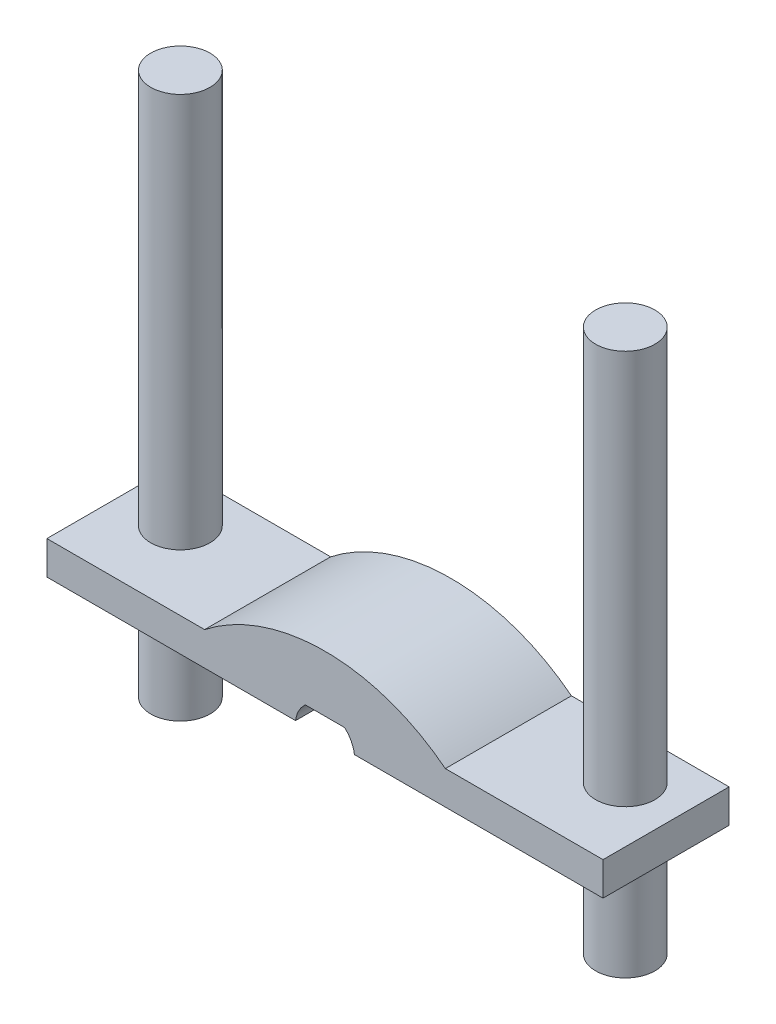
ISO-10303-21;
HEADER;
FILE_DESCRIPTION(('STEP AP214'),'2;1');
FILE_NAME('part.step','',(''),(''),'','','');
FILE_SCHEMA(('AUTOMOTIVE_DESIGN { 1 0 10303 214 1 1 1 1 }'));
ENDSEC;
DATA;
#1=APPLICATION_CONTEXT('core data for automotive mechanical design processes');
#2=APPLICATION_PROTOCOL_DEFINITION('international standard','automotive_design',2000,#1);
#3=PRODUCT_CONTEXT('',#1,'mechanical');
#4=PRODUCT('Part','Part','',(#3));
#5=PRODUCT_RELATED_PRODUCT_CATEGORY('part','',(#4));
#6=PRODUCT_DEFINITION_FORMATION('','',#4);
#7=PRODUCT_DEFINITION_CONTEXT('part definition',#1,'design');
#8=PRODUCT_DEFINITION('design','',#6,#7);
#9=PRODUCT_DEFINITION_SHAPE('','',#8);
#10=(LENGTH_UNIT() NAMED_UNIT(*) SI_UNIT(.MILLI.,.METRE.));
#11=(NAMED_UNIT(*) PLANE_ANGLE_UNIT() SI_UNIT($,.RADIAN.));
#12=(NAMED_UNIT(*) SI_UNIT($,.STERADIAN.) SOLID_ANGLE_UNIT());
#13=UNCERTAINTY_MEASURE_WITH_UNIT(LENGTH_MEASURE(1.E-05),#10,'distance_accuracy_value','');
#14=(GEOMETRIC_REPRESENTATION_CONTEXT(3) GLOBAL_UNCERTAINTY_ASSIGNED_CONTEXT((#13)) GLOBAL_UNIT_ASSIGNED_CONTEXT((#10,
#11,#12)) REPRESENTATION_CONTEXT('',''));
#15=CARTESIAN_POINT('',(0.,0.,0.));
#16=DIRECTION('',(0.,0.,1.));
#17=DIRECTION('',(1.,0.,0.));
#18=AXIS2_PLACEMENT_3D('',#15,#16,#17);
#19=CARTESIAN_POINT('',(-75.,0.999999999999994,-111.672646407854));
#20=DIRECTION('',(-1.,0.,0.));
#21=DIRECTION('',(0.,0.,1.));
#22=AXIS2_PLACEMENT_3D('',#19,#20,#21);
#23=PLANE('',#22);
#24=DIRECTION('',(0.,1.,0.));
#25=VECTOR('',#24,1.);
#26=CARTESIAN_POINT('',(-75.,0.999999999999994,-33.9999999999999));
#27=LINE('',#26,#25);
#28=CARTESIAN_POINT('',(-75.,0.999999999999994,-33.9999999999999));
#29=VERTEX_POINT('',#28);
#30=CARTESIAN_POINT('',(-75.,9.99999999999999,-33.9999999999999));
#31=VERTEX_POINT('',#30);
#32=EDGE_CURVE('E190',#29,#31,#27,.T.);
#33=ORIENTED_EDGE('',*,*,#32,.F.);
#34=DIRECTION('',(0.,0.,1.));
#35=VECTOR('',#34,1.);
#36=CARTESIAN_POINT('',(-75.,0.999999999999994,-111.672646407854));
#37=LINE('',#36,#35);
#38=CARTESIAN_POINT('',(-75.,0.999999999999994,0.));
#39=VERTEX_POINT('',#38);
#40=EDGE_CURVE('E208',#29,#39,#37,.T.);
#41=ORIENTED_EDGE('',*,*,#40,.T.);
#42=DIRECTION('',(0.,-1.,0.));
#43=VECTOR('',#42,1.);
#44=CARTESIAN_POINT('',(-75.,0.999999999999994,0.));
#45=LINE('',#44,#43);
#46=CARTESIAN_POINT('',(-75.,9.99999999999999,0.));
#47=VERTEX_POINT('',#46);
#48=EDGE_CURVE('E181',#47,#39,#45,.T.);
#49=ORIENTED_EDGE('',*,*,#48,.F.);
#50=DIRECTION('',(0.,0.,1.));
#51=VECTOR('',#50,1.);
#52=CARTESIAN_POINT('',(-75.,9.99999999999999,-111.672646407854));
#53=LINE('',#52,#51);
#54=EDGE_CURVE('E184',#31,#47,#53,.T.);
#55=ORIENTED_EDGE('',*,*,#54,.F.);
#56=EDGE_LOOP('',(#33,#41,#49,#55));
#57=FACE_BOUND('',#56,.T.);
#58=ADVANCED_FACE('F50',(#57),#23,.T.);
#59=CARTESIAN_POINT('',(-32.4694880778215,9.99999999999999,-111.672646407854));
#60=DIRECTION('',(0.,1.,0.));
#61=DIRECTION('',(-1.,0.,0.));
#62=AXIS2_PLACEMENT_3D('',#59,#60,#61);
#63=PLANE('',#62);
#64=CARTESIAN_POINT('',(-60.,9.99999999999999,-21.));
#65=DIRECTION('',(0.,1.,0.));
#66=DIRECTION('',(-1.,0.,0.));
#67=AXIS2_PLACEMENT_3D('',#64,#65,#66);
#68=CIRCLE('',#67,8.);
#69=CARTESIAN_POINT('',(-68.,9.99999999999999,-21.));
#70=VERTEX_POINT('',#69);
#71=EDGE_CURVE('E175',#70,#70,#68,.T.);
#72=ORIENTED_EDGE('',*,*,#71,.F.);
#73=EDGE_LOOP('',(#72));
#74=FACE_BOUND('',#73,.T.);
#75=DIRECTION('',(1.,0.,0.));
#76=VECTOR('',#75,1.);
#77=CARTESIAN_POINT('',(-32.4694880778215,9.99999999999999,-33.9999999999999));
#78=LINE('',#77,#76);
#79=CARTESIAN_POINT('',(-32.4694880778215,10.,-33.9999999999999));
#80=VERTEX_POINT('',#79);
#81=EDGE_CURVE('E188',#31,#80,#78,.T.);
#82=ORIENTED_EDGE('',*,*,#81,.F.);
#83=ORIENTED_EDGE('',*,*,#54,.T.);
#84=DIRECTION('',(-1.,0.,0.));
#85=VECTOR('',#84,1.);
#86=CARTESIAN_POINT('',(-32.4694880778215,9.99999999999999,0.));
#87=LINE('',#86,#85);
#88=CARTESIAN_POINT('',(-32.4694880778215,9.99999999999999,0.));
#89=VERTEX_POINT('',#88);
#90=EDGE_CURVE('E205',#89,#47,#87,.T.);
#91=ORIENTED_EDGE('',*,*,#90,.F.);
#92=DIRECTION('',(0.,0.,1.));
#93=VECTOR('',#92,1.);
#94=CARTESIAN_POINT('',(-32.4694880778215,9.99999999999999,-111.672646407854));
#95=LINE('',#94,#93);
#96=EDGE_CURVE('E210',#80,#89,#95,.T.);
#97=ORIENTED_EDGE('',*,*,#96,.F.);
#98=EDGE_LOOP('',(#82,#83,#91,#97));
#99=FACE_BOUND('',#98,.T.);
#100=ADVANCED_FACE('F232',(#74,#99),#63,.T.);
#101=CARTESIAN_POINT('',(0.,-31.4655203588068,-111.672646407854));
#102=DIRECTION('',(0.,0.,1.));
#103=DIRECTION('',(1.,0.,0.));
#104=AXIS2_PLACEMENT_3D('',#101,#102,#103);
#105=CYLINDRICAL_SURFACE('',#104,52.6655203587927);
#106=CARTESIAN_POINT('',(0.,-31.4655203588068,-33.9999999999999));
#107=DIRECTION('',(0.,0.,1.));
#108=DIRECTION('',(1.,0.,0.));
#109=AXIS2_PLACEMENT_3D('',#106,#107,#108);
#110=CIRCLE('',#109,52.6655203587927);
#111=CARTESIAN_POINT('',(32.4694880778214,10.0000000000002,-33.9999999999999));
#112=VERTEX_POINT('',#111);
#113=EDGE_CURVE('E186',#80,#112,#110,.F.);
#114=ORIENTED_EDGE('',*,*,#113,.F.);
#115=ORIENTED_EDGE('',*,*,#96,.T.);
#116=CARTESIAN_POINT('',(0.,-31.4655203588068,0.));
#117=DIRECTION('',(0.,0.,1.));
#118=DIRECTION('',(1.,0.,0.));
#119=AXIS2_PLACEMENT_3D('',#116,#117,#118);
#120=CIRCLE('',#119,52.6655203587927);
#121=CARTESIAN_POINT('',(32.4694880778214,10.0000000000002,0.));
#122=VERTEX_POINT('',#121);
#123=EDGE_CURVE('E202',#122,#89,#120,.T.);
#124=ORIENTED_EDGE('',*,*,#123,.F.);
#125=DIRECTION('',(0.,0.,1.));
#126=VECTOR('',#125,1.);
#127=CARTESIAN_POINT('',(32.4694880778214,10.0000000000002,-111.672646407854));
#128=LINE('',#127,#126);
#129=EDGE_CURVE('E161',#112,#122,#128,.T.);
#130=ORIENTED_EDGE('',*,*,#129,.F.);
#131=EDGE_LOOP('',(#114,#115,#124,#130));
#132=FACE_BOUND('',#131,.T.);
#133=ADVANCED_FACE('F236',(#132),#105,.T.);
#134=CARTESIAN_POINT('',(0.,5.99999999997181,-111.672646407854));
#135=DIRECTION('',(0.,-1.,0.));
#136=DIRECTION('',(1.,0.,0.));
#137=AXIS2_PLACEMENT_3D('',#134,#135,#136);
#138=PLANE('',#137);
#139=DIRECTION('',(-1.,0.,0.));
#140=VECTOR('',#139,1.);
#141=CARTESIAN_POINT('',(0.,5.99999999997181,-33.9999999999999));
#142=LINE('',#141,#140);
#143=CARTESIAN_POINT('',(5.29150262213204,5.99999999997589,-33.9999999999999));
#144=VERTEX_POINT('',#143);
#145=CARTESIAN_POINT('',(-5.29150262213209,5.99999999997585,-33.9999999999999));
#146=VERTEX_POINT('',#145);
#147=EDGE_CURVE('E65',#144,#146,#142,.T.);
#148=ORIENTED_EDGE('',*,*,#147,.F.);
#149=DIRECTION('',(0.,0.,1.));
#150=VECTOR('',#149,1.);
#151=CARTESIAN_POINT('',(5.29150262212847,5.99999999997185,-111.672646407854));
#152=LINE('',#151,#150);
#153=CARTESIAN_POINT('',(5.29150262212847,5.99999999997185,0.));
#154=VERTEX_POINT('',#153);
#155=EDGE_CURVE('E164',#144,#154,#152,.T.);
#156=ORIENTED_EDGE('',*,*,#155,.T.);
#157=DIRECTION('',(1.,0.,0.));
#158=VECTOR('',#157,1.);
#159=CARTESIAN_POINT('',(0.,5.99999999997181,0.));
#160=LINE('',#159,#158);
#161=CARTESIAN_POINT('',(-5.29150262212852,5.99999999997181,0.));
#162=VERTEX_POINT('',#161);
#163=EDGE_CURVE('E200',#162,#154,#160,.T.);
#164=ORIENTED_EDGE('',*,*,#163,.F.);
#165=DIRECTION('',(0.,0.,1.));
#166=VECTOR('',#165,1.);
#167=CARTESIAN_POINT('',(-5.29150262212852,5.99999999997181,-111.672646407854));
#168=LINE('',#167,#166);
#169=EDGE_CURVE('E212',#146,#162,#168,.T.);
#170=ORIENTED_EDGE('',*,*,#169,.F.);
#171=EDGE_LOOP('',(#148,#156,#164,#170));
#172=FACE_BOUND('',#171,.T.);
#173=ADVANCED_FACE('F275',(#172),#138,.T.);
#174=CARTESIAN_POINT('',(0.,0.,-111.672646407854));
#175=DIRECTION('',(0.,0.,1.));
#176=DIRECTION('',(1.,0.,0.));
#177=AXIS2_PLACEMENT_3D('',#174,#175,#176);
#178=CYLINDRICAL_SURFACE('',#177,7.99999999998381);
#179=CARTESIAN_POINT('',(0.,0.,-33.9999999999999));
#180=DIRECTION('',(0.,0.,1.));
#181=DIRECTION('',(1.,0.,0.));
#182=AXIS2_PLACEMENT_3D('',#179,#180,#181);
#183=CIRCLE('',#182,7.99999999998381);
#184=CARTESIAN_POINT('',(-7.93725393317754,0.999999999999328,-33.9999999999999));
#185=VERTEX_POINT('',#184);
#186=EDGE_CURVE('E182',#146,#185,#183,.T.);
#187=ORIENTED_EDGE('',*,*,#186,.F.);
#188=ORIENTED_EDGE('',*,*,#169,.T.);
#189=CARTESIAN_POINT('',(0.,0.,0.));
#190=DIRECTION('',(0.,0.,-1.));
#191=DIRECTION('',(1.,0.,0.));
#192=AXIS2_PLACEMENT_3D('',#189,#190,#191);
#193=CIRCLE('',#192,7.99999999998381);
#194=CARTESIAN_POINT('',(-7.93725393317754,0.999999999999328,0.));
#195=VERTEX_POINT('',#194);
#196=EDGE_CURVE('E197',#195,#162,#193,.T.);
#197=ORIENTED_EDGE('',*,*,#196,.F.);
#198=DIRECTION('',(0.,0.,1.));
#199=VECTOR('',#198,1.);
#200=CARTESIAN_POINT('',(-7.93725393317754,0.999999999999328,-111.672646407854));
#201=LINE('',#200,#199);
#202=EDGE_CURVE('E214',#185,#195,#201,.T.);
#203=ORIENTED_EDGE('',*,*,#202,.F.);
#204=EDGE_LOOP('',(#187,#188,#197,#203));
#205=FACE_BOUND('',#204,.T.);
#206=ADVANCED_FACE('F283',(#205),#178,.F.);
#207=CARTESIAN_POINT('',(-7.9372539331829,1.,-111.672646407854));
#208=DIRECTION('',(0.,-1.,0.));
#209=DIRECTION('',(1.,0.,0.));
#210=AXIS2_PLACEMENT_3D('',#207,#208,#209);
#211=PLANE('',#210);
#212=CARTESIAN_POINT('',(-60.,0.999999999999994,-21.));
#213=DIRECTION('',(0.,-1.,0.));
#214=DIRECTION('',(1.,0.,0.));
#215=AXIS2_PLACEMENT_3D('',#212,#213,#214);
#216=CIRCLE('',#215,8.);
#217=CARTESIAN_POINT('',(-52.,0.999999999999995,-21.));
#218=VERTEX_POINT('',#217);
#219=EDGE_CURVE('E13',#218,#218,#216,.T.);
#220=ORIENTED_EDGE('',*,*,#219,.F.);
#221=EDGE_LOOP('',(#220));
#222=FACE_BOUND('',#221,.T.);
#223=DIRECTION('',(-1.,0.,0.));
#224=VECTOR('',#223,1.);
#225=CARTESIAN_POINT('',(-7.9372539331829,1.,-33.9999999999999));
#226=LINE('',#225,#224);
#227=EDGE_CURVE('E58',#185,#29,#226,.T.);
#228=ORIENTED_EDGE('',*,*,#227,.F.);
#229=ORIENTED_EDGE('',*,*,#202,.T.);
#230=DIRECTION('',(1.,0.,0.));
#231=VECTOR('',#230,1.);
#232=CARTESIAN_POINT('',(-7.9372539331829,1.,0.));
#233=LINE('',#232,#231);
#234=EDGE_CURVE('E194',#39,#195,#233,.T.);
#235=ORIENTED_EDGE('',*,*,#234,.F.);
#236=ORIENTED_EDGE('',*,*,#40,.F.);
#237=EDGE_LOOP('',(#228,#229,#235,#236));
#238=FACE_BOUND('',#237,.T.);
#239=ADVANCED_FACE('F227',(#222,#238),#211,.T.);
#240=CARTESIAN_POINT('',(0.,-31.4655203588068,0.));
#241=DIRECTION('',(0.,0.,1.));
#242=DIRECTION('',(1.,0.,0.));
#243=AXIS2_PLACEMENT_3D('',#240,#241,#242);
#244=PLANE('',#243);
#245=ORIENTED_EDGE('',*,*,#48,.T.);
#246=ORIENTED_EDGE('',*,*,#234,.T.);
#247=ORIENTED_EDGE('',*,*,#196,.T.);
#248=ORIENTED_EDGE('',*,*,#163,.T.);
#249=CARTESIAN_POINT('',(0.,0.,0.));
#250=DIRECTION('',(0.,0.,1.));
#251=DIRECTION('',(-1.,0.,0.));
#252=AXIS2_PLACEMENT_3D('',#249,#250,#251);
#253=CIRCLE('',#252,7.99999999998381);
#254=CARTESIAN_POINT('',(7.93725393317753,0.999999999999383,0.));
#255=VERTEX_POINT('',#254);
#256=EDGE_CURVE('E130',#255,#154,#253,.T.);
#257=ORIENTED_EDGE('',*,*,#256,.F.);
#258=DIRECTION('',(-1.,0.,0.));
#259=VECTOR('',#258,1.);
#260=CARTESIAN_POINT('',(7.93725393318289,1.00000000000006,0.));
#261=LINE('',#260,#259);
#262=CARTESIAN_POINT('',(75.,1.00000000000054,0.));
#263=VERTEX_POINT('',#262);
#264=EDGE_CURVE('E121',#263,#255,#261,.T.);
#265=ORIENTED_EDGE('',*,*,#264,.F.);
#266=DIRECTION('',(0.,-1.,0.));
#267=VECTOR('',#266,1.);
#268=CARTESIAN_POINT('',(75.,1.00000000000054,0.));
#269=LINE('',#268,#267);
#270=CARTESIAN_POINT('',(74.9999999999999,10.0000000000005,0.));
#271=VERTEX_POINT('',#270);
#272=EDGE_CURVE('E127',#271,#263,#269,.T.);
#273=ORIENTED_EDGE('',*,*,#272,.F.);
#274=DIRECTION('',(1.,0.,0.));
#275=VECTOR('',#274,1.);
#276=CARTESIAN_POINT('',(32.4694880778214,10.0000000000002,0.));
#277=LINE('',#276,#275);
#278=EDGE_CURVE('E143',#122,#271,#277,.T.);
#279=ORIENTED_EDGE('',*,*,#278,.F.);
#280=ORIENTED_EDGE('',*,*,#123,.T.);
#281=ORIENTED_EDGE('',*,*,#90,.T.);
#282=EDGE_LOOP('',(#245,#246,#247,#248,#257,#265,#273,#279,#280,#281));
#283=FACE_BOUND('',#282,.T.);
#284=ADVANCED_FACE('F124',(#283),#244,.T.);
#285=CARTESIAN_POINT('',(-7.99999999999956,0.,-33.9999999999999));
#286=DIRECTION('',(0.,0.,1.));
#287=DIRECTION('',(0.,1.,0.));
#288=AXIS2_PLACEMENT_3D('',#285,#286,#287);
#289=PLANE('',#288);
#290=ORIENTED_EDGE('',*,*,#32,.T.);
#291=ORIENTED_EDGE('',*,*,#81,.T.);
#292=ORIENTED_EDGE('',*,*,#113,.T.);
#293=DIRECTION('',(-1.,0.,0.));
#294=VECTOR('',#293,1.);
#295=CARTESIAN_POINT('',(32.4694880778214,10.0000000000002,-33.9999999999999));
#296=LINE('',#295,#294);
#297=CARTESIAN_POINT('',(74.9999999999999,10.0000000000005,-33.9999999999999));
#298=VERTEX_POINT('',#297);
#299=EDGE_CURVE('E239',#298,#112,#296,.T.);
#300=ORIENTED_EDGE('',*,*,#299,.F.);
#301=DIRECTION('',(0.,1.,0.));
#302=VECTOR('',#301,1.);
#303=CARTESIAN_POINT('',(75.,1.00000000000054,-33.9999999999999));
#304=LINE('',#303,#302);
#305=CARTESIAN_POINT('',(75.,1.00000000000054,-33.9999999999999));
#306=VERTEX_POINT('',#305);
#307=EDGE_CURVE('E154',#306,#298,#304,.T.);
#308=ORIENTED_EDGE('',*,*,#307,.F.);
#309=DIRECTION('',(1.,0.,0.));
#310=VECTOR('',#309,1.);
#311=CARTESIAN_POINT('',(7.93725393318289,1.00000000000006,-33.9999999999999));
#312=LINE('',#311,#310);
#313=CARTESIAN_POINT('',(7.93725393317753,0.999999999999383,-33.9999999999999));
#314=VERTEX_POINT('',#313);
#315=EDGE_CURVE('E138',#314,#306,#312,.T.);
#316=ORIENTED_EDGE('',*,*,#315,.F.);
#317=CARTESIAN_POINT('',(0.,0.,-33.9999999999999));
#318=DIRECTION('',(0.,0.,-1.));
#319=DIRECTION('',(-1.,0.,0.));
#320=AXIS2_PLACEMENT_3D('',#317,#318,#319);
#321=CIRCLE('',#320,7.99999999998381);
#322=EDGE_CURVE('E160',#144,#314,#321,.T.);
#323=ORIENTED_EDGE('',*,*,#322,.F.);
#324=ORIENTED_EDGE('',*,*,#147,.T.);
#325=ORIENTED_EDGE('',*,*,#186,.T.);
#326=ORIENTED_EDGE('',*,*,#227,.T.);
#327=EDGE_LOOP('',(#290,#291,#292,#300,#308,#316,#323,#324,#325,#326));
#328=FACE_BOUND('',#327,.T.);
#329=ADVANCED_FACE('F218',(#328),#289,.F.);
#330=CARTESIAN_POINT('',(-60.,179.02741699797,-21.));
#331=DIRECTION('',(0.,-1.,0.));
#332=DIRECTION('',(1.,0.,0.));
#333=AXIS2_PLACEMENT_3D('',#330,#331,#332);
#334=CYLINDRICAL_SURFACE('',#333,8.);
#335=CARTESIAN_POINT('',(-60.,116.4,-21.));
#336=DIRECTION('',(0.,-1.,0.));
#337=DIRECTION('',(0.,0.,-1.));
#338=AXIS2_PLACEMENT_3D('',#335,#336,#337);
#339=CIRCLE('',#338,8.);
#340=CARTESIAN_POINT('',(-60.,116.4,-29.));
#341=VERTEX_POINT('',#340);
#342=EDGE_CURVE('E178',#341,#341,#339,.T.);
#343=ORIENTED_EDGE('',*,*,#342,.T.);
#344=EDGE_LOOP('',(#343));
#345=FACE_BOUND('',#344,.T.);
#346=ORIENTED_EDGE('',*,*,#71,.T.);
#347=EDGE_LOOP('',(#346));
#348=FACE_BOUND('',#347,.T.);
#349=ADVANCED_FACE('F312',(#345,#348),#334,.T.);
#350=CARTESIAN_POINT('',(-60.,116.4,-21.));
#351=DIRECTION('',(0.,-1.,0.));
#352=DIRECTION('',(1.,0.,0.));
#353=AXIS2_PLACEMENT_3D('',#350,#351,#352);
#354=PLANE('',#353);
#355=ORIENTED_EDGE('',*,*,#342,.F.);
#356=EDGE_LOOP('',(#355));
#357=FACE_BOUND('',#356,.T.);
#358=ADVANCED_FACE('F298',(#357),#354,.F.);
#359=CARTESIAN_POINT('',(-60.,-30.,-21.));
#360=DIRECTION('',(0.,1.,0.));
#361=DIRECTION('',(-1.,0.,0.));
#362=AXIS2_PLACEMENT_3D('',#359,#360,#361);
#363=CYLINDRICAL_SURFACE('',#362,8.);
#364=ORIENTED_EDGE('',*,*,#219,.T.);
#365=EDGE_LOOP('',(#364));
#366=FACE_BOUND('',#365,.T.);
#367=CARTESIAN_POINT('',(-60.,-30.,-21.));
#368=DIRECTION('',(0.,1.,0.));
#369=DIRECTION('',(-1.,0.,0.));
#370=AXIS2_PLACEMENT_3D('',#367,#368,#369);
#371=CIRCLE('',#370,8.);
#372=CARTESIAN_POINT('',(-68.,-30.,-21.));
#373=VERTEX_POINT('',#372);
#374=EDGE_CURVE('E172',#373,#373,#371,.T.);
#375=ORIENTED_EDGE('',*,*,#374,.T.);
#376=EDGE_LOOP('',(#375));
#377=FACE_BOUND('',#376,.T.);
#378=ADVANCED_FACE('F294',(#366,#377),#363,.T.);
#379=CARTESIAN_POINT('',(-60.,-30.,-21.));
#380=DIRECTION('',(0.,1.,0.));
#381=DIRECTION('',(-1.,0.,0.));
#382=AXIS2_PLACEMENT_3D('',#379,#380,#381);
#383=PLANE('',#382);
#384=ORIENTED_EDGE('',*,*,#374,.F.);
#385=EDGE_LOOP('',(#384));
#386=FACE_BOUND('',#385,.T.);
#387=ADVANCED_FACE('F297',(#386),#383,.F.);
#388=CARTESIAN_POINT('',(75.,1.00000000000054,-111.672646407854));
#389=DIRECTION('',(1.,0.,0.));
#390=DIRECTION('',(0.,0.,1.));
#391=AXIS2_PLACEMENT_3D('',#388,#389,#390);
#392=PLANE('',#391);
#393=ORIENTED_EDGE('',*,*,#307,.T.);
#394=DIRECTION('',(0.,0.,1.));
#395=VECTOR('',#394,1.);
#396=CARTESIAN_POINT('',(74.9999999999999,10.0000000000005,-111.672646407854));
#397=LINE('',#396,#395);
#398=EDGE_CURVE('E147',#298,#271,#397,.T.);
#399=ORIENTED_EDGE('',*,*,#398,.T.);
#400=ORIENTED_EDGE('',*,*,#272,.T.);
#401=DIRECTION('',(0.,0.,1.));
#402=VECTOR('',#401,1.);
#403=CARTESIAN_POINT('',(75.,1.00000000000054,-111.672646407854));
#404=LINE('',#403,#402);
#405=EDGE_CURVE('E136',#306,#263,#404,.T.);
#406=ORIENTED_EDGE('',*,*,#405,.F.);
#407=EDGE_LOOP('',(#393,#399,#400,#406));
#408=FACE_BOUND('',#407,.T.);
#409=ADVANCED_FACE('F145',(#408),#392,.T.);
#410=CARTESIAN_POINT('',(32.4694880778214,10.0000000000002,-111.672646407854));
#411=DIRECTION('',(0.,1.,0.));
#412=DIRECTION('',(1.,0.,0.));
#413=AXIS2_PLACEMENT_3D('',#410,#411,#412);
#414=PLANE('',#413);
#415=CARTESIAN_POINT('',(59.9999999999999,10.0000000000004,-21.));
#416=DIRECTION('',(0.,-1.,0.));
#417=DIRECTION('',(1.,0.,0.));
#418=AXIS2_PLACEMENT_3D('',#415,#416,#417);
#419=CIRCLE('',#418,8.);
#420=CARTESIAN_POINT('',(67.9999999999999,10.0000000000005,-21.));
#421=VERTEX_POINT('',#420);
#422=EDGE_CURVE('E151',#421,#421,#419,.T.);
#423=ORIENTED_EDGE('',*,*,#422,.T.);
#424=EDGE_LOOP('',(#423));
#425=FACE_BOUND('',#424,.T.);
#426=ORIENTED_EDGE('',*,*,#299,.T.);
#427=ORIENTED_EDGE('',*,*,#129,.T.);
#428=ORIENTED_EDGE('',*,*,#278,.T.);
#429=ORIENTED_EDGE('',*,*,#398,.F.);
#430=EDGE_LOOP('',(#426,#427,#428,#429));
#431=FACE_BOUND('',#430,.T.);
#432=ADVANCED_FACE('F240',(#425,#431),#414,.T.);
#433=CARTESIAN_POINT('',(0.,0.,-111.672646407854));
#434=DIRECTION('',(0.,0.,1.));
#435=DIRECTION('',(-1.,0.,0.));
#436=AXIS2_PLACEMENT_3D('',#433,#434,#435);
#437=CYLINDRICAL_SURFACE('',#436,7.99999999998381);
#438=ORIENTED_EDGE('',*,*,#322,.T.);
#439=DIRECTION('',(0.,0.,1.));
#440=VECTOR('',#439,1.);
#441=CARTESIAN_POINT('',(7.93725393317753,0.999999999999383,-111.672646407854));
#442=LINE('',#441,#440);
#443=EDGE_CURVE('E142',#314,#255,#442,.T.);
#444=ORIENTED_EDGE('',*,*,#443,.T.);
#445=ORIENTED_EDGE('',*,*,#256,.T.);
#446=ORIENTED_EDGE('',*,*,#155,.F.);
#447=EDGE_LOOP('',(#438,#444,#445,#446));
#448=FACE_BOUND('',#447,.T.);
#449=ADVANCED_FACE('F367',(#448),#437,.F.);
#450=CARTESIAN_POINT('',(7.93725393318289,1.00000000000006,-111.672646407854));
#451=DIRECTION('',(0.,-1.,0.));
#452=DIRECTION('',(-1.,0.,0.));
#453=AXIS2_PLACEMENT_3D('',#450,#451,#452);
#454=PLANE('',#453);
#455=CARTESIAN_POINT('',(60.,1.00000000000043,-21.));
#456=DIRECTION('',(0.,1.,0.));
#457=DIRECTION('',(-1.,0.,0.));
#458=AXIS2_PLACEMENT_3D('',#455,#456,#457);
#459=CIRCLE('',#458,8.);
#460=CARTESIAN_POINT('',(52.,1.00000000000037,-21.));
#461=VERTEX_POINT('',#460);
#462=EDGE_CURVE('E169',#461,#461,#459,.T.);
#463=ORIENTED_EDGE('',*,*,#462,.T.);
#464=EDGE_LOOP('',(#463));
#465=FACE_BOUND('',#464,.T.);
#466=ORIENTED_EDGE('',*,*,#315,.T.);
#467=ORIENTED_EDGE('',*,*,#405,.T.);
#468=ORIENTED_EDGE('',*,*,#264,.T.);
#469=ORIENTED_EDGE('',*,*,#443,.F.);
#470=EDGE_LOOP('',(#466,#467,#468,#469));
#471=FACE_BOUND('',#470,.T.);
#472=ADVANCED_FACE('F137',(#465,#471),#454,.T.);
#473=CARTESIAN_POINT('',(59.9999999999987,179.02741699797,-21.));
#474=DIRECTION('',(0.,-1.,0.));
#475=DIRECTION('',(-1.,0.,0.));
#476=AXIS2_PLACEMENT_3D('',#473,#474,#475);
#477=CYLINDRICAL_SURFACE('',#476,8.);
#478=CARTESIAN_POINT('',(59.9999999999992,116.400000000001,-21.));
#479=DIRECTION('',(0.,1.,0.));
#480=DIRECTION('',(0.,0.,-1.));
#481=AXIS2_PLACEMENT_3D('',#478,#479,#480);
#482=CIRCLE('',#481,8.);
#483=CARTESIAN_POINT('',(59.9999999999992,116.400000000001,-29.));
#484=VERTEX_POINT('',#483);
#485=EDGE_CURVE('E148',#484,#484,#482,.T.);
#486=ORIENTED_EDGE('',*,*,#485,.F.);
#487=EDGE_LOOP('',(#486));
#488=FACE_BOUND('',#487,.T.);
#489=ORIENTED_EDGE('',*,*,#422,.F.);
#490=EDGE_LOOP('',(#489));
#491=FACE_BOUND('',#490,.T.);
#492=ADVANCED_FACE('F262',(#488,#491),#477,.T.);
#493=CARTESIAN_POINT('',(59.9999999999991,116.400000000001,-21.));
#494=DIRECTION('',(0.,-1.,0.));
#495=DIRECTION('',(-1.,0.,0.));
#496=AXIS2_PLACEMENT_3D('',#493,#494,#495);
#497=PLANE('',#496);
#498=ORIENTED_EDGE('',*,*,#485,.T.);
#499=EDGE_LOOP('',(#498));
#500=FACE_BOUND('',#499,.T.);
#501=ADVANCED_FACE('F254',(#500),#497,.F.);
#502=CARTESIAN_POINT('',(60.0000000000002,-29.9999999999996,-21.));
#503=DIRECTION('',(0.,1.,0.));
#504=DIRECTION('',(1.,0.,0.));
#505=AXIS2_PLACEMENT_3D('',#502,#503,#504);
#506=CYLINDRICAL_SURFACE('',#505,8.);
#507=ORIENTED_EDGE('',*,*,#462,.F.);
#508=EDGE_LOOP('',(#507));
#509=FACE_BOUND('',#508,.T.);
#510=CARTESIAN_POINT('',(60.0000000000002,-29.9999999999996,-21.));
#511=DIRECTION('',(0.,-1.,0.));
#512=DIRECTION('',(1.,0.,0.));
#513=AXIS2_PLACEMENT_3D('',#510,#511,#512);
#514=CIRCLE('',#513,8.);
#515=CARTESIAN_POINT('',(68.0000000000002,-29.9999999999995,-21.));
#516=VERTEX_POINT('',#515);
#517=EDGE_CURVE('E246',#516,#516,#514,.T.);
#518=ORIENTED_EDGE('',*,*,#517,.F.);
#519=EDGE_LOOP('',(#518));
#520=FACE_BOUND('',#519,.T.);
#521=ADVANCED_FACE('F252',(#509,#520),#506,.T.);
#522=CARTESIAN_POINT('',(60.0000000000002,-29.9999999999996,-21.));
#523=DIRECTION('',(0.,1.,0.));
#524=DIRECTION('',(1.,0.,0.));
#525=AXIS2_PLACEMENT_3D('',#522,#523,#524);
#526=PLANE('',#525);
#527=ORIENTED_EDGE('',*,*,#517,.T.);
#528=EDGE_LOOP('',(#527));
#529=FACE_BOUND('',#528,.T.);
#530=ADVANCED_FACE('F250',(#529),#526,.F.);
#531=CLOSED_SHELL('',(#58,#100,#133,#173,#206,#239,#284,#329,#349,#358,#378,#387,#409,#432,#449,
#472,#492,#501,#521,#530));
#532=MANIFOLD_SOLID_BREP('B2',#531);
#533=ADVANCED_BREP_SHAPE_REPRESENTATION('',(#18,#532),#14);
#534=SHAPE_DEFINITION_REPRESENTATION(#9,#533);
ENDSEC;
END-ISO-10303-21;
